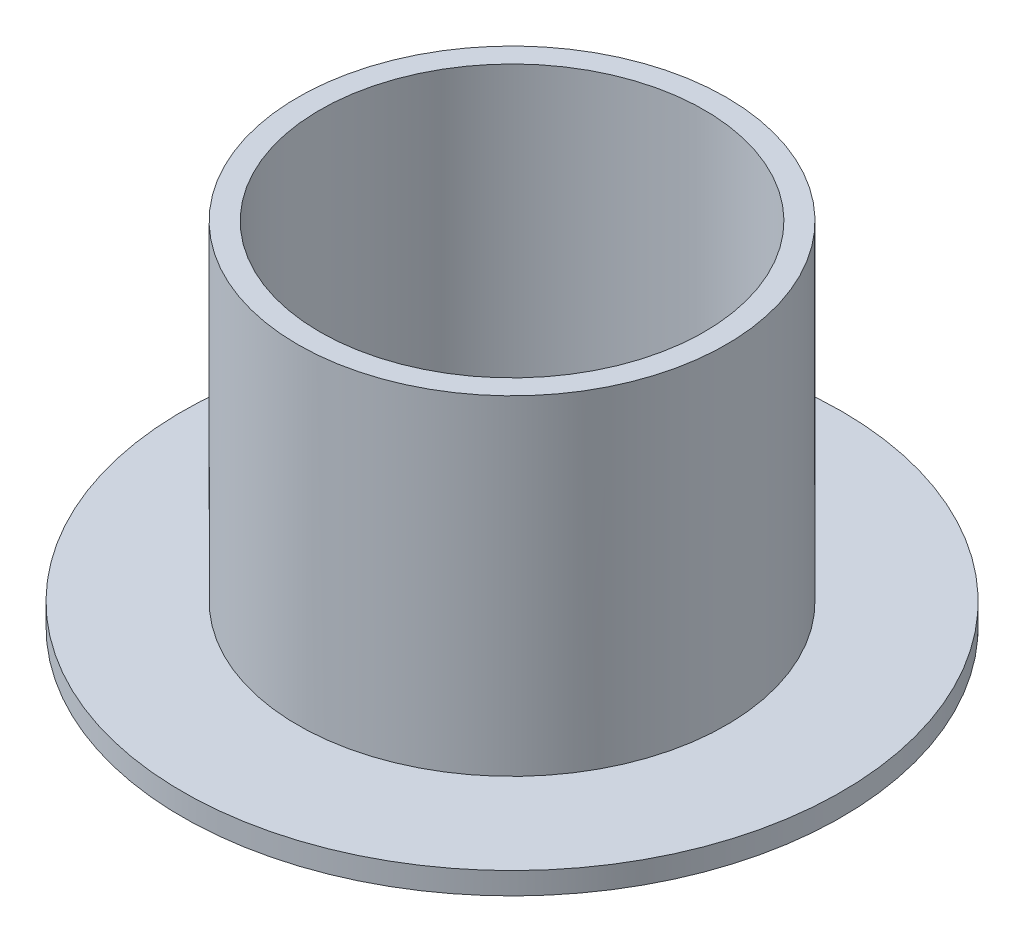
ISO-10303-21;
HEADER;
FILE_DESCRIPTION(('STEP AP214'),'2;1');
FILE_NAME('part.step','',(''),(''),'','','');
FILE_SCHEMA(('AUTOMOTIVE_DESIGN { 1 0 10303 214 1 1 1 1 }'));
ENDSEC;
DATA;
#1=APPLICATION_CONTEXT('core data for automotive mechanical design processes');
#2=APPLICATION_PROTOCOL_DEFINITION('international standard','automotive_design',2000,#1);
#3=PRODUCT_CONTEXT('',#1,'mechanical');
#4=PRODUCT('Part','Part','',(#3));
#5=PRODUCT_RELATED_PRODUCT_CATEGORY('part','',(#4));
#6=PRODUCT_DEFINITION_FORMATION('','',#4);
#7=PRODUCT_DEFINITION_CONTEXT('part definition',#1,'design');
#8=PRODUCT_DEFINITION('design','',#6,#7);
#9=PRODUCT_DEFINITION_SHAPE('','',#8);
#10=(LENGTH_UNIT() NAMED_UNIT(*) SI_UNIT(.MILLI.,.METRE.));
#11=(NAMED_UNIT(*) PLANE_ANGLE_UNIT() SI_UNIT($,.RADIAN.));
#12=(NAMED_UNIT(*) SI_UNIT($,.STERADIAN.) SOLID_ANGLE_UNIT());
#13=UNCERTAINTY_MEASURE_WITH_UNIT(LENGTH_MEASURE(1.E-05),#10,'distance_accuracy_value','');
#14=(GEOMETRIC_REPRESENTATION_CONTEXT(3) GLOBAL_UNCERTAINTY_ASSIGNED_CONTEXT((#13)) GLOBAL_UNIT_ASSIGNED_CONTEXT((#10,
#11,#12)) REPRESENTATION_CONTEXT('',''));
#15=CARTESIAN_POINT('',(0.,0.,0.));
#16=DIRECTION('',(0.,0.,1.));
#17=DIRECTION('',(1.,0.,0.));
#18=AXIS2_PLACEMENT_3D('',#15,#16,#17);
#19=CARTESIAN_POINT('',(0.,30.,0.));
#20=DIRECTION('',(0.,1.,0.));
#21=DIRECTION('',(0.,0.,1.));
#22=AXIS2_PLACEMENT_3D('',#19,#20,#21);
#23=PLANE('',#22);
#24=CARTESIAN_POINT('',(0.,30.,0.));
#25=DIRECTION('',(0.,1.,0.));
#26=DIRECTION('',(0.,0.,1.));
#27=AXIS2_PLACEMENT_3D('',#24,#25,#26);
#28=CIRCLE('',#27,19.5);
#29=CARTESIAN_POINT('',(0.,30.,19.5));
#30=VERTEX_POINT('',#29);
#31=EDGE_CURVE('E10',#30,#30,#28,.T.);
#32=ORIENTED_EDGE('',*,*,#31,.T.);
#33=EDGE_LOOP('',(#32));
#34=FACE_BOUND('',#33,.T.);
#35=CARTESIAN_POINT('',(0.,30.,0.));
#36=DIRECTION('',(0.,1.,0.));
#37=DIRECTION('',(0.,0.,1.));
#38=AXIS2_PLACEMENT_3D('',#35,#36,#37);
#39=CIRCLE('',#38,17.5);
#40=CARTESIAN_POINT('',(0.,30.,17.5));
#41=VERTEX_POINT('',#40);
#42=EDGE_CURVE('E38',#41,#41,#39,.T.);
#43=ORIENTED_EDGE('',*,*,#42,.F.);
#44=EDGE_LOOP('',(#43));
#45=FACE_BOUND('',#44,.T.);
#46=ADVANCED_FACE('F31',(#34,#45),#23,.T.);
#47=CARTESIAN_POINT('',(0.,30.,0.));
#48=DIRECTION('',(0.,-1.,0.));
#49=DIRECTION('',(0.,0.,-1.));
#50=AXIS2_PLACEMENT_3D('',#47,#48,#49);
#51=CYLINDRICAL_SURFACE('',#50,19.5);
#52=ORIENTED_EDGE('',*,*,#31,.F.);
#53=EDGE_LOOP('',(#52));
#54=FACE_BOUND('',#53,.T.);
#55=CARTESIAN_POINT('',(0.,0.,0.));
#56=DIRECTION('',(0.,-1.,0.));
#57=DIRECTION('',(0.,0.,-1.));
#58=AXIS2_PLACEMENT_3D('',#55,#56,#57);
#59=CIRCLE('',#58,19.5);
#60=CARTESIAN_POINT('',(0.,0.,-19.5));
#61=VERTEX_POINT('',#60);
#62=EDGE_CURVE('E47',#61,#61,#59,.T.);
#63=ORIENTED_EDGE('',*,*,#62,.F.);
#64=EDGE_LOOP('',(#63));
#65=FACE_BOUND('',#64,.T.);
#66=ADVANCED_FACE('F33',(#54,#65),#51,.T.);
#67=CARTESIAN_POINT('',(0.,30.,0.));
#68=DIRECTION('',(0.,-1.,0.));
#69=DIRECTION('',(0.,0.,-1.));
#70=AXIS2_PLACEMENT_3D('',#67,#68,#69);
#71=CYLINDRICAL_SURFACE('',#70,17.5);
#72=ORIENTED_EDGE('',*,*,#42,.T.);
#73=EDGE_LOOP('',(#72));
#74=FACE_BOUND('',#73,.T.);
#75=CARTESIAN_POINT('',(0.,0.,0.));
#76=DIRECTION('',(0.,1.,0.));
#77=DIRECTION('',(0.,0.,1.));
#78=AXIS2_PLACEMENT_3D('',#75,#76,#77);
#79=CIRCLE('',#78,17.5);
#80=CARTESIAN_POINT('',(0.,0.,17.5));
#81=VERTEX_POINT('',#80);
#82=EDGE_CURVE('E42',#81,#81,#79,.T.);
#83=ORIENTED_EDGE('',*,*,#82,.F.);
#84=EDGE_LOOP('',(#83));
#85=FACE_BOUND('',#84,.T.);
#86=ADVANCED_FACE('F74',(#74,#85),#71,.F.);
#87=CARTESIAN_POINT('',(0.,0.,0.));
#88=DIRECTION('',(0.,-1.,0.));
#89=DIRECTION('',(0.,0.,-1.));
#90=AXIS2_PLACEMENT_3D('',#87,#88,#89);
#91=PLANE('',#90);
#92=ORIENTED_EDGE('',*,*,#82,.T.);
#93=EDGE_LOOP('',(#92));
#94=FACE_BOUND('',#93,.T.);
#95=ADVANCED_FACE('F69',(#94),#91,.F.);
#96=CARTESIAN_POINT('',(0.,0.,0.));
#97=DIRECTION('',(0.,-1.,0.));
#98=DIRECTION('',(0.,0.,-1.));
#99=AXIS2_PLACEMENT_3D('',#96,#97,#98);
#100=CIRCLE('',#99,30.);
#101=CARTESIAN_POINT('',(0.,0.,-30.));
#102=VERTEX_POINT('',#101);
#103=EDGE_CURVE('E52',#102,#102,#100,.T.);
#104=ORIENTED_EDGE('',*,*,#103,.F.);
#105=EDGE_LOOP('',(#104));
#106=FACE_BOUND('',#105,.T.);
#107=ORIENTED_EDGE('',*,*,#62,.T.);
#108=EDGE_LOOP('',(#107));
#109=FACE_BOUND('',#108,.T.);
#110=ADVANCED_FACE('F63',(#106,#109),#91,.F.);
#111=CARTESIAN_POINT('',(0.,-2.,0.));
#112=DIRECTION('',(0.,1.,0.));
#113=DIRECTION('',(0.,0.,1.));
#114=AXIS2_PLACEMENT_3D('',#111,#112,#113);
#115=CYLINDRICAL_SURFACE('',#114,30.);
#116=CARTESIAN_POINT('',(0.,-2.,0.));
#117=DIRECTION('',(0.,-1.,0.));
#118=DIRECTION('',(0.,0.,-1.));
#119=AXIS2_PLACEMENT_3D('',#116,#117,#118);
#120=CIRCLE('',#119,30.);
#121=CARTESIAN_POINT('',(0.,-2.,-30.));
#122=VERTEX_POINT('',#121);
#123=EDGE_CURVE('E51',#122,#122,#120,.T.);
#124=ORIENTED_EDGE('',*,*,#123,.F.);
#125=EDGE_LOOP('',(#124));
#126=FACE_BOUND('',#125,.T.);
#127=ORIENTED_EDGE('',*,*,#103,.T.);
#128=EDGE_LOOP('',(#127));
#129=FACE_BOUND('',#128,.T.);
#130=ADVANCED_FACE('F60',(#126,#129),#115,.T.);
#131=CARTESIAN_POINT('',(0.,-2.,0.));
#132=DIRECTION('',(0.,-1.,0.));
#133=DIRECTION('',(0.,0.,-1.));
#134=AXIS2_PLACEMENT_3D('',#131,#132,#133);
#135=PLANE('',#134);
#136=ORIENTED_EDGE('',*,*,#123,.T.);
#137=EDGE_LOOP('',(#136));
#138=FACE_BOUND('',#137,.T.);
#139=ADVANCED_FACE('F58',(#138),#135,.T.);
#140=CLOSED_SHELL('',(#46,#66,#86,#95,#110,#130,#139));
#141=MANIFOLD_SOLID_BREP('B2',#140);
#142=ADVANCED_BREP_SHAPE_REPRESENTATION('',(#18,#141),#14);
#143=SHAPE_DEFINITION_REPRESENTATION(#9,#142);
ENDSEC;
END-ISO-10303-21;
